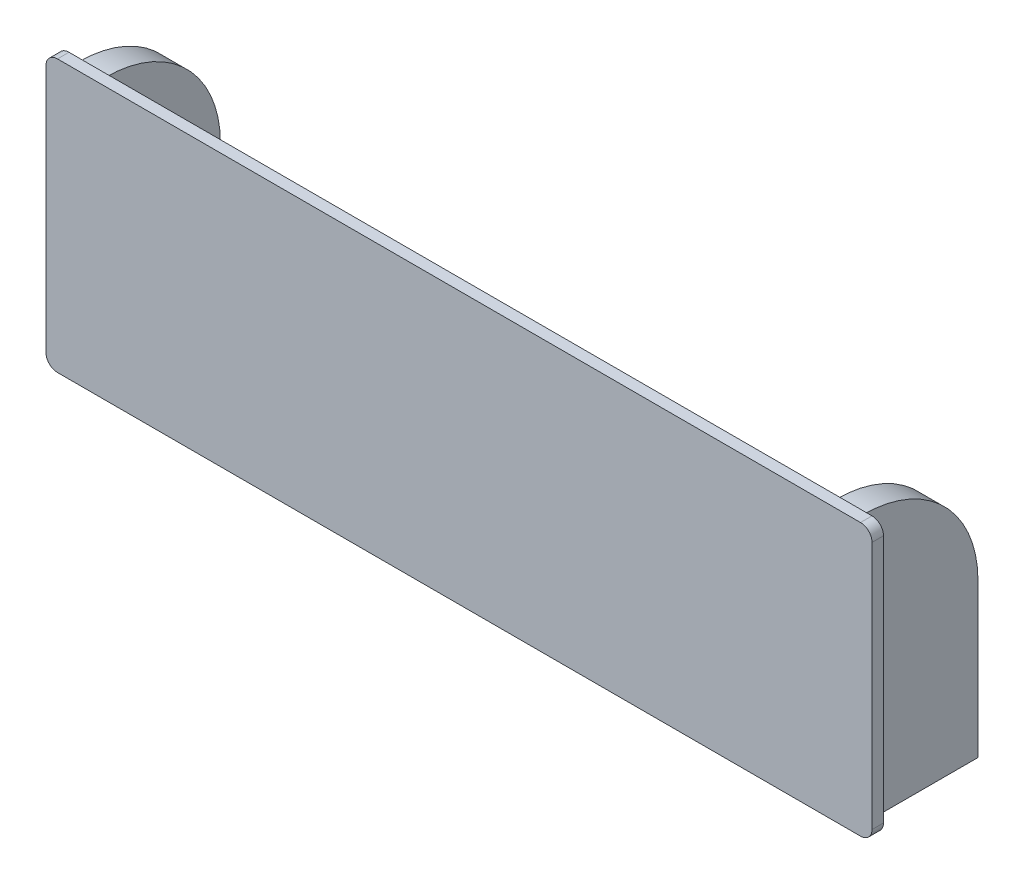
ISO-10303-21;
HEADER;
FILE_DESCRIPTION(('STEP AP214'),'2;1');
FILE_NAME('part.step','',(''),(''),'','','');
FILE_SCHEMA(('AUTOMOTIVE_DESIGN { 1 0 10303 214 1 1 1 1 }'));
ENDSEC;
DATA;
#1=APPLICATION_CONTEXT('core data for automotive mechanical design processes');
#2=APPLICATION_PROTOCOL_DEFINITION('international standard','automotive_design',2000,#1);
#3=PRODUCT_CONTEXT('',#1,'mechanical');
#4=PRODUCT('Part','Part','',(#3));
#5=PRODUCT_RELATED_PRODUCT_CATEGORY('part','',(#4));
#6=PRODUCT_DEFINITION_FORMATION('','',#4);
#7=PRODUCT_DEFINITION_CONTEXT('part definition',#1,'design');
#8=PRODUCT_DEFINITION('design','',#6,#7);
#9=PRODUCT_DEFINITION_SHAPE('','',#8);
#10=(LENGTH_UNIT() NAMED_UNIT(*) SI_UNIT(.MILLI.,.METRE.));
#11=(NAMED_UNIT(*) PLANE_ANGLE_UNIT() SI_UNIT($,.RADIAN.));
#12=(NAMED_UNIT(*) SI_UNIT($,.STERADIAN.) SOLID_ANGLE_UNIT());
#13=UNCERTAINTY_MEASURE_WITH_UNIT(LENGTH_MEASURE(1.E-05),#10,'distance_accuracy_value','');
#14=(GEOMETRIC_REPRESENTATION_CONTEXT(3) GLOBAL_UNCERTAINTY_ASSIGNED_CONTEXT((#13)) GLOBAL_UNIT_ASSIGNED_CONTEXT((#10,
#11,#12)) REPRESENTATION_CONTEXT('',''));
#15=CARTESIAN_POINT('',(0.,0.,0.));
#16=DIRECTION('',(0.,0.,1.));
#17=DIRECTION('',(1.,0.,0.));
#18=AXIS2_PLACEMENT_3D('',#15,#16,#17);
#19=CARTESIAN_POINT('',(0.,0.,30.15));
#20=DIRECTION('',(0.,0.,1.));
#21=DIRECTION('',(1.,0.,0.));
#22=AXIS2_PLACEMENT_3D('',#19,#20,#21);
#23=PLANE('',#22);
#24=DIRECTION('',(1.,0.,0.));
#25=VECTOR('',#24,1.);
#26=CARTESIAN_POINT('',(210.45,0.,30.15));
#27=LINE('',#26,#25);
#28=CARTESIAN_POINT('',(-2.44999999999998,0.,30.15));
#29=VERTEX_POINT('',#28);
#30=CARTESIAN_POINT('',(0.,0.,30.15));
#31=VERTEX_POINT('',#30);
#32=EDGE_CURVE('E213',#29,#31,#27,.T.);
#33=ORIENTED_EDGE('',*,*,#32,.F.);
#34=CARTESIAN_POINT('',(-2.44999999999998,3.,30.15));
#35=DIRECTION('',(0.,0.,1.));
#36=DIRECTION('',(1.,0.,0.));
#37=AXIS2_PLACEMENT_3D('',#34,#35,#36);
#38=CIRCLE('',#37,3.);
#39=CARTESIAN_POINT('',(-5.44999999999998,3.,30.15));
#40=VERTEX_POINT('',#39);
#41=EDGE_CURVE('E278',#29,#40,#38,.F.);
#42=ORIENTED_EDGE('',*,*,#41,.T.);
#43=DIRECTION('',(0.,-1.,0.));
#44=VECTOR('',#43,1.);
#45=CARTESIAN_POINT('',(-5.44999999999998,0.,30.15));
#46=LINE('',#45,#44);
#47=CARTESIAN_POINT('',(-5.44999999999998,68.,30.15));
#48=VERTEX_POINT('',#47);
#49=EDGE_CURVE('E226',#48,#40,#46,.T.);
#50=ORIENTED_EDGE('',*,*,#49,.F.);
#51=CARTESIAN_POINT('',(-2.44999999999998,68.,30.15));
#52=DIRECTION('',(0.,0.,1.));
#53=DIRECTION('',(1.,0.,0.));
#54=AXIS2_PLACEMENT_3D('',#51,#52,#53);
#55=CIRCLE('',#54,3.);
#56=CARTESIAN_POINT('',(-2.44999999999998,71.,30.15));
#57=VERTEX_POINT('',#56);
#58=EDGE_CURVE('E272',#48,#57,#55,.F.);
#59=ORIENTED_EDGE('',*,*,#58,.T.);
#60=DIRECTION('',(-1.,0.,0.));
#61=VECTOR('',#60,1.);
#62=CARTESIAN_POINT('',(210.45,71.,30.15));
#63=LINE('',#62,#61);
#64=CARTESIAN_POINT('',(207.45,71.,30.15));
#65=VERTEX_POINT('',#64);
#66=EDGE_CURVE('E224',#65,#57,#63,.T.);
#67=ORIENTED_EDGE('',*,*,#66,.F.);
#68=CARTESIAN_POINT('',(207.45,68.,30.15));
#69=DIRECTION('',(0.,0.,1.));
#70=DIRECTION('',(1.,0.,0.));
#71=AXIS2_PLACEMENT_3D('',#68,#69,#70);
#72=CIRCLE('',#71,3.);
#73=CARTESIAN_POINT('',(210.45,68.,30.15));
#74=VERTEX_POINT('',#73);
#75=EDGE_CURVE('E274',#65,#74,#72,.F.);
#76=ORIENTED_EDGE('',*,*,#75,.T.);
#77=DIRECTION('',(0.,1.,0.));
#78=VECTOR('',#77,1.);
#79=CARTESIAN_POINT('',(210.45,0.,30.15));
#80=LINE('',#79,#78);
#81=CARTESIAN_POINT('',(210.45,3.,30.15));
#82=VERTEX_POINT('',#81);
#83=EDGE_CURVE('E209',#82,#74,#80,.T.);
#84=ORIENTED_EDGE('',*,*,#83,.F.);
#85=CARTESIAN_POINT('',(207.45,3.,30.15));
#86=DIRECTION('',(0.,0.,1.));
#87=DIRECTION('',(1.,0.,0.));
#88=AXIS2_PLACEMENT_3D('',#85,#86,#87);
#89=CIRCLE('',#88,3.);
#90=CARTESIAN_POINT('',(207.45,0.,30.15));
#91=VERTEX_POINT('',#90);
#92=EDGE_CURVE('E276',#82,#91,#89,.F.);
#93=ORIENTED_EDGE('',*,*,#92,.T.);
#94=CARTESIAN_POINT('',(205.,0.,30.15));
#95=VERTEX_POINT('',#94);
#96=EDGE_CURVE('E167',#95,#91,#27,.T.);
#97=ORIENTED_EDGE('',*,*,#96,.F.);
#98=DIRECTION('',(0.,1.,0.));
#99=VECTOR('',#98,1.);
#100=CARTESIAN_POINT('',(205.,0.,30.15));
#101=LINE('',#100,#99);
#102=CARTESIAN_POINT('',(205.,70.,30.15));
#103=VERTEX_POINT('',#102);
#104=EDGE_CURVE('E160',#95,#103,#101,.T.);
#105=ORIENTED_EDGE('',*,*,#104,.T.);
#106=DIRECTION('',(-1.,0.,0.));
#107=VECTOR('',#106,1.);
#108=CARTESIAN_POINT('',(198.,70.,30.15));
#109=LINE('',#108,#107);
#110=CARTESIAN_POINT('',(198.,70.,30.15));
#111=VERTEX_POINT('',#110);
#112=EDGE_CURVE('E164',#103,#111,#109,.T.);
#113=ORIENTED_EDGE('',*,*,#112,.T.);
#114=DIRECTION('',(0.,-1.,0.));
#115=VECTOR('',#114,1.);
#116=CARTESIAN_POINT('',(198.,0.,30.15));
#117=LINE('',#116,#115);
#118=CARTESIAN_POINT('',(198.,0.,30.15));
#119=VERTEX_POINT('',#118);
#120=EDGE_CURVE('E171',#111,#119,#117,.T.);
#121=ORIENTED_EDGE('',*,*,#120,.T.);
#122=CARTESIAN_POINT('',(6.99999999999967,0.,30.15));
#123=VERTEX_POINT('',#122);
#124=EDGE_CURVE('E230',#123,#119,#27,.T.);
#125=ORIENTED_EDGE('',*,*,#124,.F.);
#126=DIRECTION('',(0.,1.,0.));
#127=VECTOR('',#126,1.);
#128=CARTESIAN_POINT('',(6.99999999999967,0.,30.15));
#129=LINE('',#128,#127);
#130=CARTESIAN_POINT('',(7.,70.,30.15));
#131=VERTEX_POINT('',#130);
#132=EDGE_CURVE('E234',#123,#131,#129,.T.);
#133=ORIENTED_EDGE('',*,*,#132,.T.);
#134=DIRECTION('',(-1.,0.,0.));
#135=VECTOR('',#134,1.);
#136=CARTESIAN_POINT('',(0.,70.,30.15));
#137=LINE('',#136,#135);
#138=CARTESIAN_POINT('',(0.,70.,30.15));
#139=VERTEX_POINT('',#138);
#140=EDGE_CURVE('E238',#131,#139,#137,.T.);
#141=ORIENTED_EDGE('',*,*,#140,.T.);
#142=DIRECTION('',(0.,-1.,0.));
#143=VECTOR('',#142,1.);
#144=CARTESIAN_POINT('',(0.,0.,30.15));
#145=LINE('',#144,#143);
#146=EDGE_CURVE('E231',#139,#31,#145,.T.);
#147=ORIENTED_EDGE('',*,*,#146,.T.);
#148=EDGE_LOOP('',(#33,#42,#50,#59,#67,#76,#84,#93,#97,#105,#113,#121,#125,#133,#141,#147));
#149=FACE_BOUND('',#148,.T.);
#150=ADVANCED_FACE('F35',(#149),#23,.F.);
#151=CARTESIAN_POINT('',(0.,0.,30.15));
#152=DIRECTION('',(1.,0.,0.));
#153=DIRECTION('',(0.,0.,-1.));
#154=AXIS2_PLACEMENT_3D('',#151,#152,#153);
#155=PLANE('',#154);
#156=DIRECTION('',(0.,0.,-1.));
#157=VECTOR('',#156,1.);
#158=CARTESIAN_POINT('',(0.,70.,30.15));
#159=LINE('',#158,#157);
#160=CARTESIAN_POINT('',(0.,70.,30.));
#161=VERTEX_POINT('',#160);
#162=EDGE_CURVE('E241',#139,#161,#159,.T.);
#163=ORIENTED_EDGE('',*,*,#162,.T.);
#164=CARTESIAN_POINT('',(0.,40.,30.));
#165=DIRECTION('',(1.,0.,0.));
#166=DIRECTION('',(0.,0.,-1.));
#167=AXIS2_PLACEMENT_3D('',#164,#165,#166);
#168=CIRCLE('',#167,30.);
#169=CARTESIAN_POINT('',(0.,40.,0.));
#170=VERTEX_POINT('',#169);
#171=EDGE_CURVE('E261',#161,#170,#168,.F.);
#172=ORIENTED_EDGE('',*,*,#171,.T.);
#173=DIRECTION('',(0.,-1.,0.));
#174=VECTOR('',#173,1.);
#175=CARTESIAN_POINT('',(0.,0.,0.));
#176=LINE('',#175,#174);
#177=CARTESIAN_POINT('',(0.,0.,0.));
#178=VERTEX_POINT('',#177);
#179=EDGE_CURVE('E221',#170,#178,#176,.T.);
#180=ORIENTED_EDGE('',*,*,#179,.T.);
#181=DIRECTION('',(0.,0.,-1.));
#182=VECTOR('',#181,1.);
#183=CARTESIAN_POINT('',(0.,0.,30.15));
#184=LINE('',#183,#182);
#185=EDGE_CURVE('E255',#31,#178,#184,.T.);
#186=ORIENTED_EDGE('',*,*,#185,.F.);
#187=ORIENTED_EDGE('',*,*,#146,.F.);
#188=EDGE_LOOP('',(#163,#172,#180,#186,#187));
#189=FACE_BOUND('',#188,.T.);
#190=ADVANCED_FACE('F337',(#189),#155,.F.);
#191=CARTESIAN_POINT('',(0.,0.,30.15));
#192=DIRECTION('',(0.,1.,0.));
#193=DIRECTION('',(0.,0.,1.));
#194=AXIS2_PLACEMENT_3D('',#191,#192,#193);
#195=PLANE('',#194);
#196=DIRECTION('',(1.,0.,0.));
#197=VECTOR('',#196,1.);
#198=CARTESIAN_POINT('',(210.45,0.,33.15));
#199=LINE('',#198,#197);
#200=CARTESIAN_POINT('',(-2.44999999999998,0.,33.15));
#201=VERTEX_POINT('',#200);
#202=CARTESIAN_POINT('',(207.45,0.,33.15));
#203=VERTEX_POINT('',#202);
#204=EDGE_CURVE('E218',#201,#203,#199,.T.);
#205=ORIENTED_EDGE('',*,*,#204,.F.);
#206=DIRECTION('',(0.,0.,-1.));
#207=VECTOR('',#206,1.);
#208=CARTESIAN_POINT('',(-2.44999999999998,0.,30.15));
#209=LINE('',#208,#207);
#210=EDGE_CURVE('E269',#201,#29,#209,.T.);
#211=ORIENTED_EDGE('',*,*,#210,.T.);
#212=ORIENTED_EDGE('',*,*,#32,.T.);
#213=ORIENTED_EDGE('',*,*,#185,.T.);
#214=DIRECTION('',(1.,0.,0.));
#215=VECTOR('',#214,1.);
#216=CARTESIAN_POINT('',(0.,0.,0.));
#217=LINE('',#216,#215);
#218=CARTESIAN_POINT('',(6.99999999999967,0.,0.));
#219=VERTEX_POINT('',#218);
#220=EDGE_CURVE('E243',#178,#219,#217,.T.);
#221=ORIENTED_EDGE('',*,*,#220,.T.);
#222=DIRECTION('',(0.,0.,-1.));
#223=VECTOR('',#222,1.);
#224=CARTESIAN_POINT('',(6.99999999999967,0.,30.15));
#225=LINE('',#224,#223);
#226=EDGE_CURVE('E252',#123,#219,#225,.T.);
#227=ORIENTED_EDGE('',*,*,#226,.F.);
#228=ORIENTED_EDGE('',*,*,#124,.T.);
#229=DIRECTION('',(0.,0.,-1.));
#230=VECTOR('',#229,1.);
#231=CARTESIAN_POINT('',(198.,0.,30.15));
#232=LINE('',#231,#230);
#233=CARTESIAN_POINT('',(198.,0.,0.));
#234=VERTEX_POINT('',#233);
#235=EDGE_CURVE('E199',#119,#234,#232,.T.);
#236=ORIENTED_EDGE('',*,*,#235,.T.);
#237=DIRECTION('',(1.,0.,0.));
#238=VECTOR('',#237,1.);
#239=CARTESIAN_POINT('',(198.,0.,0.));
#240=LINE('',#239,#238);
#241=CARTESIAN_POINT('',(205.,0.,0.));
#242=VERTEX_POINT('',#241);
#243=EDGE_CURVE('E194',#234,#242,#240,.T.);
#244=ORIENTED_EDGE('',*,*,#243,.T.);
#245=DIRECTION('',(0.,0.,-1.));
#246=VECTOR('',#245,1.);
#247=CARTESIAN_POINT('',(205.,0.,30.15));
#248=LINE('',#247,#246);
#249=EDGE_CURVE('E182',#95,#242,#248,.T.);
#250=ORIENTED_EDGE('',*,*,#249,.F.);
#251=ORIENTED_EDGE('',*,*,#96,.T.);
#252=DIRECTION('',(0.,0.,-1.));
#253=VECTOR('',#252,1.);
#254=CARTESIAN_POINT('',(207.45,0.,30.15));
#255=LINE('',#254,#253);
#256=EDGE_CURVE('E267',#91,#203,#255,.F.);
#257=ORIENTED_EDGE('',*,*,#256,.T.);
#258=EDGE_LOOP('',(#205,#211,#212,#213,#221,#227,#228,#236,#244,#250,#251,#257));
#259=FACE_BOUND('',#258,.T.);
#260=ADVANCED_FACE('F324',(#259),#195,.F.);
#261=CARTESIAN_POINT('',(6.99999999999967,0.,30.15));
#262=DIRECTION('',(-1.,0.,0.));
#263=DIRECTION('',(0.,-1.,0.));
#264=AXIS2_PLACEMENT_3D('',#261,#262,#263);
#265=PLANE('',#264);
#266=DIRECTION('',(0.,1.,0.));
#267=VECTOR('',#266,1.);
#268=CARTESIAN_POINT('',(6.99999999999967,0.,0.));
#269=LINE('',#268,#267);
#270=CARTESIAN_POINT('',(6.99999999999986,40.,0.));
#271=VERTEX_POINT('',#270);
#272=EDGE_CURVE('E235',#219,#271,#269,.T.);
#273=ORIENTED_EDGE('',*,*,#272,.T.);
#274=CARTESIAN_POINT('',(6.99999999999986,40.,30.));
#275=DIRECTION('',(-1.,0.,0.));
#276=DIRECTION('',(0.,-1.,0.));
#277=AXIS2_PLACEMENT_3D('',#274,#275,#276);
#278=CIRCLE('',#277,30.);
#279=CARTESIAN_POINT('',(7.,70.,30.));
#280=VERTEX_POINT('',#279);
#281=EDGE_CURVE('E265',#271,#280,#278,.F.);
#282=ORIENTED_EDGE('',*,*,#281,.T.);
#283=DIRECTION('',(0.,0.,-1.));
#284=VECTOR('',#283,1.);
#285=CARTESIAN_POINT('',(7.,70.,30.15));
#286=LINE('',#285,#284);
#287=EDGE_CURVE('E249',#131,#280,#286,.T.);
#288=ORIENTED_EDGE('',*,*,#287,.F.);
#289=ORIENTED_EDGE('',*,*,#132,.F.);
#290=ORIENTED_EDGE('',*,*,#226,.T.);
#291=EDGE_LOOP('',(#273,#282,#288,#289,#290));
#292=FACE_BOUND('',#291,.T.);
#293=ADVANCED_FACE('F361',(#292),#265,.F.);
#294=CARTESIAN_POINT('',(0.,70.,30.15));
#295=DIRECTION('',(0.,-1.,0.));
#296=DIRECTION('',(0.,0.,-1.));
#297=AXIS2_PLACEMENT_3D('',#294,#295,#296);
#298=PLANE('',#297);
#299=ORIENTED_EDGE('',*,*,#287,.T.);
#300=DIRECTION('',(-1.,0.,0.));
#301=VECTOR('',#300,1.);
#302=CARTESIAN_POINT('',(0.,70.,30.));
#303=LINE('',#302,#301);
#304=EDGE_CURVE('E258',#280,#161,#303,.T.);
#305=ORIENTED_EDGE('',*,*,#304,.T.);
#306=ORIENTED_EDGE('',*,*,#162,.F.);
#307=ORIENTED_EDGE('',*,*,#140,.F.);
#308=EDGE_LOOP('',(#299,#305,#306,#307));
#309=FACE_BOUND('',#308,.T.);
#310=ADVANCED_FACE('F357',(#309),#298,.F.);
#311=CARTESIAN_POINT('',(0.,0.,0.));
#312=DIRECTION('',(0.,0.,-1.));
#313=DIRECTION('',(-1.,0.,0.));
#314=AXIS2_PLACEMENT_3D('',#311,#312,#313);
#315=PLANE('',#314);
#316=ORIENTED_EDGE('',*,*,#179,.F.);
#317=DIRECTION('',(-1.,0.,0.));
#318=VECTOR('',#317,1.);
#319=CARTESIAN_POINT('',(7.,40.,0.));
#320=LINE('',#319,#318);
#321=EDGE_CURVE('E263',#170,#271,#320,.F.);
#322=ORIENTED_EDGE('',*,*,#321,.T.);
#323=ORIENTED_EDGE('',*,*,#272,.F.);
#324=ORIENTED_EDGE('',*,*,#220,.F.);
#325=EDGE_LOOP('',(#316,#322,#323,#324));
#326=FACE_BOUND('',#325,.T.);
#327=ADVANCED_FACE('F354',(#326),#315,.T.);
#328=CARTESIAN_POINT('',(0.,40.,30.));
#329=DIRECTION('',(1.,0.,0.));
#330=DIRECTION('',(0.,0.,-1.));
#331=AXIS2_PLACEMENT_3D('',#328,#329,#330);
#332=CYLINDRICAL_SURFACE('',#331,30.);
#333=ORIENTED_EDGE('',*,*,#281,.F.);
#334=ORIENTED_EDGE('',*,*,#321,.F.);
#335=ORIENTED_EDGE('',*,*,#171,.F.);
#336=ORIENTED_EDGE('',*,*,#304,.F.);
#337=EDGE_LOOP('',(#333,#334,#335,#336));
#338=FACE_BOUND('',#337,.T.);
#339=ADVANCED_FACE('F353',(#338),#332,.T.);
#340=CARTESIAN_POINT('',(210.45,0.,33.15));
#341=DIRECTION('',(-1.,0.,0.));
#342=DIRECTION('',(0.,0.,1.));
#343=AXIS2_PLACEMENT_3D('',#340,#341,#342);
#344=PLANE('',#343);
#345=DIRECTION('',(0.,1.,0.));
#346=VECTOR('',#345,1.);
#347=CARTESIAN_POINT('',(210.45,0.,33.15));
#348=LINE('',#347,#346);
#349=CARTESIAN_POINT('',(210.45,3.,33.15));
#350=VERTEX_POINT('',#349);
#351=CARTESIAN_POINT('',(210.45,68.,33.15));
#352=VERTEX_POINT('',#351);
#353=EDGE_CURVE('E210',#350,#352,#348,.T.);
#354=ORIENTED_EDGE('',*,*,#353,.F.);
#355=DIRECTION('',(0.,0.,-1.));
#356=VECTOR('',#355,1.);
#357=CARTESIAN_POINT('',(210.45,3.,33.15));
#358=LINE('',#357,#356);
#359=EDGE_CURVE('E294',#350,#82,#358,.T.);
#360=ORIENTED_EDGE('',*,*,#359,.T.);
#361=ORIENTED_EDGE('',*,*,#83,.T.);
#362=DIRECTION('',(0.,0.,-1.));
#363=VECTOR('',#362,1.);
#364=CARTESIAN_POINT('',(210.45,68.,33.15));
#365=LINE('',#364,#363);
#366=EDGE_CURVE('E292',#74,#352,#365,.F.);
#367=ORIENTED_EDGE('',*,*,#366,.T.);
#368=EDGE_LOOP('',(#354,#360,#361,#367));
#369=FACE_BOUND('',#368,.T.);
#370=ADVANCED_FACE('F300',(#369),#344,.F.);
#371=CARTESIAN_POINT('',(210.45,71.,33.15));
#372=DIRECTION('',(0.,-1.,0.));
#373=DIRECTION('',(1.,0.,0.));
#374=AXIS2_PLACEMENT_3D('',#371,#372,#373);
#375=PLANE('',#374);
#376=DIRECTION('',(-1.,0.,0.));
#377=VECTOR('',#376,1.);
#378=CARTESIAN_POINT('',(210.45,71.,33.15));
#379=LINE('',#378,#377);
#380=CARTESIAN_POINT('',(207.45,71.,33.15));
#381=VERTEX_POINT('',#380);
#382=CARTESIAN_POINT('',(-2.44999999999998,71.,33.15));
#383=VERTEX_POINT('',#382);
#384=EDGE_CURVE('E212',#381,#383,#379,.T.);
#385=ORIENTED_EDGE('',*,*,#384,.F.);
#386=DIRECTION('',(0.,0.,-1.));
#387=VECTOR('',#386,1.);
#388=CARTESIAN_POINT('',(207.45,71.,33.15));
#389=LINE('',#388,#387);
#390=EDGE_CURVE('E11',#381,#65,#389,.T.);
#391=ORIENTED_EDGE('',*,*,#390,.T.);
#392=ORIENTED_EDGE('',*,*,#66,.T.);
#393=DIRECTION('',(0.,0.,-1.));
#394=VECTOR('',#393,1.);
#395=CARTESIAN_POINT('',(-2.44999999999998,71.,33.15));
#396=LINE('',#395,#394);
#397=EDGE_CURVE('E43',#57,#383,#396,.F.);
#398=ORIENTED_EDGE('',*,*,#397,.T.);
#399=EDGE_LOOP('',(#385,#391,#392,#398));
#400=FACE_BOUND('',#399,.T.);
#401=ADVANCED_FACE('F308',(#400),#375,.F.);
#402=CARTESIAN_POINT('',(-5.44999999999998,0.,33.15));
#403=DIRECTION('',(1.,0.,0.));
#404=DIRECTION('',(0.,0.,-1.));
#405=AXIS2_PLACEMENT_3D('',#402,#403,#404);
#406=PLANE('',#405);
#407=ORIENTED_EDGE('',*,*,#49,.T.);
#408=DIRECTION('',(0.,0.,-1.));
#409=VECTOR('',#408,1.);
#410=CARTESIAN_POINT('',(-5.44999999999998,3.,33.15));
#411=LINE('',#410,#409);
#412=CARTESIAN_POINT('',(-5.44999999999998,3.,33.15));
#413=VERTEX_POINT('',#412);
#414=EDGE_CURVE('E283',#40,#413,#411,.F.);
#415=ORIENTED_EDGE('',*,*,#414,.T.);
#416=DIRECTION('',(0.,-1.,0.));
#417=VECTOR('',#416,1.);
#418=CARTESIAN_POINT('',(-5.44999999999998,0.,33.15));
#419=LINE('',#418,#417);
#420=CARTESIAN_POINT('',(-5.44999999999998,68.,33.15));
#421=VERTEX_POINT('',#420);
#422=EDGE_CURVE('E215',#421,#413,#419,.T.);
#423=ORIENTED_EDGE('',*,*,#422,.F.);
#424=DIRECTION('',(0.,0.,-1.));
#425=VECTOR('',#424,1.);
#426=CARTESIAN_POINT('',(-5.44999999999998,68.,33.15));
#427=LINE('',#426,#425);
#428=EDGE_CURVE('E280',#421,#48,#427,.T.);
#429=ORIENTED_EDGE('',*,*,#428,.T.);
#430=EDGE_LOOP('',(#407,#415,#423,#429));
#431=FACE_BOUND('',#430,.T.);
#432=ADVANCED_FACE('F316',(#431),#406,.F.);
#433=CARTESIAN_POINT('',(0.,0.,33.15));
#434=DIRECTION('',(0.,0.,1.));
#435=DIRECTION('',(1.,0.,0.));
#436=AXIS2_PLACEMENT_3D('',#433,#434,#435);
#437=PLANE('',#436);
#438=ORIENTED_EDGE('',*,*,#422,.T.);
#439=CARTESIAN_POINT('',(-2.44999999999998,3.,33.15));
#440=DIRECTION('',(0.,0.,1.));
#441=DIRECTION('',(1.,0.,0.));
#442=AXIS2_PLACEMENT_3D('',#439,#440,#441);
#443=CIRCLE('',#442,3.);
#444=EDGE_CURVE('E290',#413,#201,#443,.T.);
#445=ORIENTED_EDGE('',*,*,#444,.T.);
#446=ORIENTED_EDGE('',*,*,#204,.T.);
#447=CARTESIAN_POINT('',(207.45,3.,33.15));
#448=DIRECTION('',(0.,0.,1.));
#449=DIRECTION('',(1.,0.,0.));
#450=AXIS2_PLACEMENT_3D('',#447,#448,#449);
#451=CIRCLE('',#450,3.);
#452=EDGE_CURVE('E288',#203,#350,#451,.T.);
#453=ORIENTED_EDGE('',*,*,#452,.T.);
#454=ORIENTED_EDGE('',*,*,#353,.T.);
#455=CARTESIAN_POINT('',(207.45,68.,33.15));
#456=DIRECTION('',(0.,0.,1.));
#457=DIRECTION('',(1.,0.,0.));
#458=AXIS2_PLACEMENT_3D('',#455,#456,#457);
#459=CIRCLE('',#458,3.);
#460=EDGE_CURVE('E56',#352,#381,#459,.T.);
#461=ORIENTED_EDGE('',*,*,#460,.T.);
#462=ORIENTED_EDGE('',*,*,#384,.T.);
#463=CARTESIAN_POINT('',(-2.44999999999998,68.,33.15));
#464=DIRECTION('',(0.,0.,1.));
#465=DIRECTION('',(1.,0.,0.));
#466=AXIS2_PLACEMENT_3D('',#463,#464,#465);
#467=CIRCLE('',#466,3.);
#468=EDGE_CURVE('E285',#383,#421,#467,.T.);
#469=ORIENTED_EDGE('',*,*,#468,.T.);
#470=EDGE_LOOP('',(#438,#445,#446,#453,#454,#461,#462,#469));
#471=FACE_BOUND('',#470,.T.);
#472=ADVANCED_FACE('F310',(#471),#437,.T.);
#473=CARTESIAN_POINT('',(198.,0.,30.15));
#474=DIRECTION('',(1.,0.,0.));
#475=DIRECTION('',(0.,0.,-1.));
#476=AXIS2_PLACEMENT_3D('',#473,#474,#475);
#477=PLANE('',#476);
#478=DIRECTION('',(0.,0.,-1.));
#479=VECTOR('',#478,1.);
#480=CARTESIAN_POINT('',(198.,70.,30.15));
#481=LINE('',#480,#479);
#482=CARTESIAN_POINT('',(198.,70.,30.));
#483=VERTEX_POINT('',#482);
#484=EDGE_CURVE('E183',#111,#483,#481,.T.);
#485=ORIENTED_EDGE('',*,*,#484,.T.);
#486=CARTESIAN_POINT('',(198.,40.,30.));
#487=DIRECTION('',(1.,0.,0.));
#488=DIRECTION('',(0.,0.,-1.));
#489=AXIS2_PLACEMENT_3D('',#486,#487,#488);
#490=CIRCLE('',#489,30.);
#491=CARTESIAN_POINT('',(198.,40.,0.));
#492=VERTEX_POINT('',#491);
#493=EDGE_CURVE('E204',#483,#492,#490,.F.);
#494=ORIENTED_EDGE('',*,*,#493,.T.);
#495=DIRECTION('',(0.,-1.,0.));
#496=VECTOR('',#495,1.);
#497=CARTESIAN_POINT('',(198.,0.,0.));
#498=LINE('',#497,#496);
#499=EDGE_CURVE('E192',#492,#234,#498,.T.);
#500=ORIENTED_EDGE('',*,*,#499,.T.);
#501=ORIENTED_EDGE('',*,*,#235,.F.);
#502=ORIENTED_EDGE('',*,*,#120,.F.);
#503=EDGE_LOOP('',(#485,#494,#500,#501,#502));
#504=FACE_BOUND('',#503,.T.);
#505=ADVANCED_FACE('F385',(#504),#477,.F.);
#506=CARTESIAN_POINT('',(205.,0.,30.15));
#507=DIRECTION('',(-1.,0.,0.));
#508=DIRECTION('',(0.,0.,1.));
#509=AXIS2_PLACEMENT_3D('',#506,#507,#508);
#510=PLANE('',#509);
#511=DIRECTION('',(0.,1.,0.));
#512=VECTOR('',#511,1.);
#513=CARTESIAN_POINT('',(205.,0.,0.));
#514=LINE('',#513,#512);
#515=CARTESIAN_POINT('',(205.,40.,0.));
#516=VERTEX_POINT('',#515);
#517=EDGE_CURVE('E196',#242,#516,#514,.T.);
#518=ORIENTED_EDGE('',*,*,#517,.T.);
#519=CARTESIAN_POINT('',(205.,40.,30.));
#520=DIRECTION('',(-1.,0.,0.));
#521=DIRECTION('',(0.,0.,1.));
#522=AXIS2_PLACEMENT_3D('',#519,#520,#521);
#523=CIRCLE('',#522,30.);
#524=CARTESIAN_POINT('',(205.,70.,30.));
#525=VERTEX_POINT('',#524);
#526=EDGE_CURVE('E178',#516,#525,#523,.F.);
#527=ORIENTED_EDGE('',*,*,#526,.T.);
#528=DIRECTION('',(0.,0.,-1.));
#529=VECTOR('',#528,1.);
#530=CARTESIAN_POINT('',(205.,70.,30.15));
#531=LINE('',#530,#529);
#532=EDGE_CURVE('E174',#103,#525,#531,.T.);
#533=ORIENTED_EDGE('',*,*,#532,.F.);
#534=ORIENTED_EDGE('',*,*,#104,.F.);
#535=ORIENTED_EDGE('',*,*,#249,.T.);
#536=EDGE_LOOP('',(#518,#527,#533,#534,#535));
#537=FACE_BOUND('',#536,.T.);
#538=ADVANCED_FACE('F176',(#537),#510,.F.);
#539=CARTESIAN_POINT('',(198.,70.,30.15));
#540=DIRECTION('',(0.,-1.,0.));
#541=DIRECTION('',(0.,0.,-1.));
#542=AXIS2_PLACEMENT_3D('',#539,#540,#541);
#543=PLANE('',#542);
#544=ORIENTED_EDGE('',*,*,#532,.T.);
#545=DIRECTION('',(-1.,0.,0.));
#546=VECTOR('',#545,1.);
#547=CARTESIAN_POINT('',(198.,70.,30.));
#548=LINE('',#547,#546);
#549=EDGE_CURVE('E202',#525,#483,#548,.T.);
#550=ORIENTED_EDGE('',*,*,#549,.T.);
#551=ORIENTED_EDGE('',*,*,#484,.F.);
#552=ORIENTED_EDGE('',*,*,#112,.F.);
#553=EDGE_LOOP('',(#544,#550,#551,#552));
#554=FACE_BOUND('',#553,.T.);
#555=ADVANCED_FACE('F185',(#554),#543,.F.);
#556=CARTESIAN_POINT('',(0.,0.,0.));
#557=DIRECTION('',(0.,0.,-1.));
#558=DIRECTION('',(-1.,0.,0.));
#559=AXIS2_PLACEMENT_3D('',#556,#557,#558);
#560=PLANE('',#559);
#561=ORIENTED_EDGE('',*,*,#499,.F.);
#562=DIRECTION('',(-1.,0.,0.));
#563=VECTOR('',#562,1.);
#564=CARTESIAN_POINT('',(205.,40.,0.));
#565=LINE('',#564,#563);
#566=EDGE_CURVE('E206',#492,#516,#565,.F.);
#567=ORIENTED_EDGE('',*,*,#566,.T.);
#568=ORIENTED_EDGE('',*,*,#517,.F.);
#569=ORIENTED_EDGE('',*,*,#243,.F.);
#570=EDGE_LOOP('',(#561,#567,#568,#569));
#571=FACE_BOUND('',#570,.T.);
#572=ADVANCED_FACE('F391',(#571),#560,.T.);
#573=CARTESIAN_POINT('',(198.,40.,30.));
#574=DIRECTION('',(1.,0.,0.));
#575=DIRECTION('',(0.,0.,-1.));
#576=AXIS2_PLACEMENT_3D('',#573,#574,#575);
#577=CYLINDRICAL_SURFACE('',#576,30.);
#578=ORIENTED_EDGE('',*,*,#526,.F.);
#579=ORIENTED_EDGE('',*,*,#566,.F.);
#580=ORIENTED_EDGE('',*,*,#493,.F.);
#581=ORIENTED_EDGE('',*,*,#549,.F.);
#582=EDGE_LOOP('',(#578,#579,#580,#581));
#583=FACE_BOUND('',#582,.T.);
#584=ADVANCED_FACE('F334',(#583),#577,.T.);
#585=CARTESIAN_POINT('',(-2.44999999999998,3.,30.15));
#586=DIRECTION('',(0.,0.,-1.));
#587=DIRECTION('',(-1.,0.,0.));
#588=AXIS2_PLACEMENT_3D('',#585,#586,#587);
#589=CYLINDRICAL_SURFACE('',#588,3.);
#590=ORIENTED_EDGE('',*,*,#444,.F.);
#591=ORIENTED_EDGE('',*,*,#414,.F.);
#592=ORIENTED_EDGE('',*,*,#41,.F.);
#593=ORIENTED_EDGE('',*,*,#210,.F.);
#594=EDGE_LOOP('',(#590,#591,#592,#593));
#595=FACE_BOUND('',#594,.T.);
#596=ADVANCED_FACE('F321',(#595),#589,.T.);
#597=CARTESIAN_POINT('',(207.45,3.,33.15));
#598=DIRECTION('',(0.,0.,-1.));
#599=DIRECTION('',(-1.,0.,0.));
#600=AXIS2_PLACEMENT_3D('',#597,#598,#599);
#601=CYLINDRICAL_SURFACE('',#600,3.);
#602=ORIENTED_EDGE('',*,*,#452,.F.);
#603=ORIENTED_EDGE('',*,*,#256,.F.);
#604=ORIENTED_EDGE('',*,*,#92,.F.);
#605=ORIENTED_EDGE('',*,*,#359,.F.);
#606=EDGE_LOOP('',(#602,#603,#604,#605));
#607=FACE_BOUND('',#606,.T.);
#608=ADVANCED_FACE('F327',(#607),#601,.T.);
#609=CARTESIAN_POINT('',(207.45,68.,33.15));
#610=DIRECTION('',(0.,0.,-1.));
#611=DIRECTION('',(-1.,0.,0.));
#612=AXIS2_PLACEMENT_3D('',#609,#610,#611);
#613=CYLINDRICAL_SURFACE('',#612,3.);
#614=ORIENTED_EDGE('',*,*,#460,.F.);
#615=ORIENTED_EDGE('',*,*,#366,.F.);
#616=ORIENTED_EDGE('',*,*,#75,.F.);
#617=ORIENTED_EDGE('',*,*,#390,.F.);
#618=EDGE_LOOP('',(#614,#615,#616,#617));
#619=FACE_BOUND('',#618,.T.);
#620=ADVANCED_FACE('F307',(#619),#613,.T.);
#621=CARTESIAN_POINT('',(-2.44999999999998,68.,33.15));
#622=DIRECTION('',(0.,0.,-1.));
#623=DIRECTION('',(-1.,0.,0.));
#624=AXIS2_PLACEMENT_3D('',#621,#622,#623);
#625=CYLINDRICAL_SURFACE('',#624,3.);
#626=ORIENTED_EDGE('',*,*,#468,.F.);
#627=ORIENTED_EDGE('',*,*,#397,.F.);
#628=ORIENTED_EDGE('',*,*,#58,.F.);
#629=ORIENTED_EDGE('',*,*,#428,.F.);
#630=EDGE_LOOP('',(#626,#627,#628,#629));
#631=FACE_BOUND('',#630,.T.);
#632=ADVANCED_FACE('F37',(#631),#625,.T.);
#633=CLOSED_SHELL('',(#150,#190,#260,#293,#310,#327,#339,#370,#401,#432,#472,#505,#538,#555,
#572,#584,#596,#608,#620,#632));
#634=MANIFOLD_SOLID_BREP('B2',#633);
#635=ADVANCED_BREP_SHAPE_REPRESENTATION('',(#18,#634),#14);
#636=SHAPE_DEFINITION_REPRESENTATION(#9,#635);
ENDSEC;
END-ISO-10303-21;
